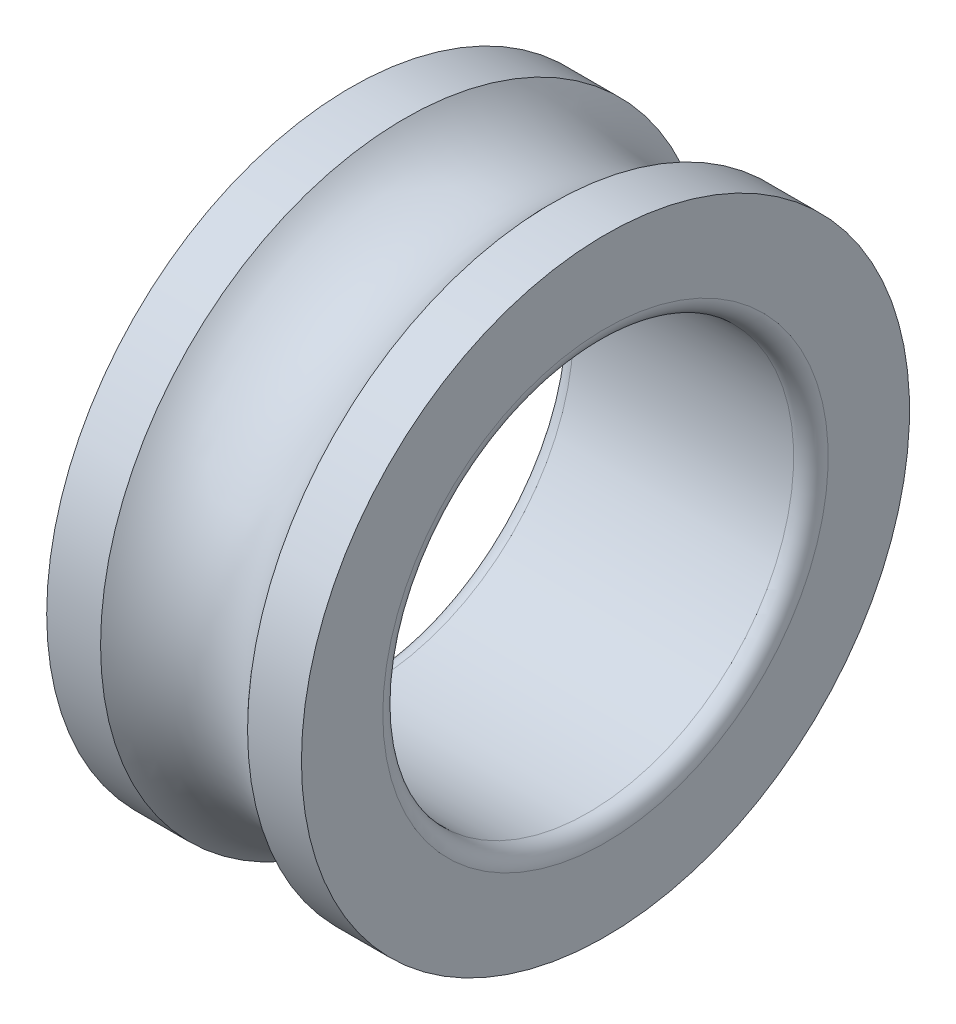
ISO-10303-21;
HEADER;
FILE_DESCRIPTION(('STEP AP214'),'2;1');
FILE_NAME('part.step','',(''),(''),'','','');
FILE_SCHEMA(('AUTOMOTIVE_DESIGN { 1 0 10303 214 1 1 1 1 }'));
ENDSEC;
DATA;
#1=APPLICATION_CONTEXT('core data for automotive mechanical design processes');
#2=APPLICATION_PROTOCOL_DEFINITION('international standard','automotive_design',2000,#1);
#3=PRODUCT_CONTEXT('',#1,'mechanical');
#4=PRODUCT('Part','Part','',(#3));
#5=PRODUCT_RELATED_PRODUCT_CATEGORY('part','',(#4));
#6=PRODUCT_DEFINITION_FORMATION('','',#4);
#7=PRODUCT_DEFINITION_CONTEXT('part definition',#1,'design');
#8=PRODUCT_DEFINITION('design','',#6,#7);
#9=PRODUCT_DEFINITION_SHAPE('','',#8);
#10=(LENGTH_UNIT() NAMED_UNIT(*) SI_UNIT(.MILLI.,.METRE.));
#11=(NAMED_UNIT(*) PLANE_ANGLE_UNIT() SI_UNIT($,.RADIAN.));
#12=(NAMED_UNIT(*) SI_UNIT($,.STERADIAN.) SOLID_ANGLE_UNIT());
#13=UNCERTAINTY_MEASURE_WITH_UNIT(LENGTH_MEASURE(1.E-05),#10,'distance_accuracy_value','');
#14=(GEOMETRIC_REPRESENTATION_CONTEXT(3) GLOBAL_UNCERTAINTY_ASSIGNED_CONTEXT((#13)) GLOBAL_UNIT_ASSIGNED_CONTEXT((#10,
#11,#12)) REPRESENTATION_CONTEXT('',''));
#15=CARTESIAN_POINT('',(0.,0.,0.));
#16=DIRECTION('',(0.,0.,1.));
#17=DIRECTION('',(1.,0.,0.));
#18=AXIS2_PLACEMENT_3D('',#15,#16,#17);
#19=CARTESIAN_POINT('',(-2.93684210526316,0.,0.));
#20=DIRECTION('',(-1.,0.,0.));
#21=DIRECTION('',(0.,0.,1.));
#22=AXIS2_PLACEMENT_3D('',#19,#20,#21);
#23=CYLINDRICAL_SURFACE('',#22,4.44);
#24=CARTESIAN_POINT('',(1.0733126291999,0.,0.));
#25=DIRECTION('',(-1.,0.,0.));
#26=DIRECTION('',(0.,0.,1.));
#27=AXIS2_PLACEMENT_3D('',#24,#25,#26);
#28=CIRCLE('',#27,4.44);
#29=CARTESIAN_POINT('',(1.0733126291999,0.,4.44));
#30=VERTEX_POINT('',#29);
#31=EDGE_CURVE('E10',#30,#30,#28,.T.);
#32=ORIENTED_EDGE('',*,*,#31,.F.);
#33=EDGE_LOOP('',(#32));
#34=FACE_BOUND('',#33,.T.);
#35=CARTESIAN_POINT('',(1.86,0.,0.));
#36=DIRECTION('',(-1.,0.,0.));
#37=DIRECTION('',(0.,0.,1.));
#38=AXIS2_PLACEMENT_3D('',#35,#36,#37);
#39=CIRCLE('',#38,4.44);
#40=CARTESIAN_POINT('',(1.86,0.,4.44));
#41=VERTEX_POINT('',#40);
#42=EDGE_CURVE('E66',#41,#41,#39,.T.);
#43=ORIENTED_EDGE('',*,*,#42,.T.);
#44=EDGE_LOOP('',(#43));
#45=FACE_BOUND('',#44,.T.);
#46=ADVANCED_FACE('F38',(#34,#45),#23,.T.);
#47=CARTESIAN_POINT('',(0.,0.,0.));
#48=DIRECTION('',(-1.,0.,0.));
#49=DIRECTION('',(0.,0.,1.));
#50=AXIS2_PLACEMENT_3D('',#47,#48,#49);
#51=TOROIDAL_SURFACE('',#50,5.4,1.44);
#52=CARTESIAN_POINT('',(-1.0733126291999,0.,0.));
#53=DIRECTION('',(-1.,0.,0.));
#54=DIRECTION('',(0.,0.,1.));
#55=AXIS2_PLACEMENT_3D('',#52,#53,#54);
#56=CIRCLE('',#55,4.44);
#57=CARTESIAN_POINT('',(-1.0733126291999,0.,4.44));
#58=VERTEX_POINT('',#57);
#59=EDGE_CURVE('E44',#58,#58,#56,.T.);
#60=ORIENTED_EDGE('',*,*,#59,.F.);
#61=EDGE_LOOP('',(#60));
#62=FACE_BOUND('',#61,.T.);
#63=ORIENTED_EDGE('',*,*,#31,.T.);
#64=EDGE_LOOP('',(#63));
#65=FACE_BOUND('',#64,.T.);
#66=ADVANCED_FACE('F103',(#62,#65),#51,.F.);
#67=CARTESIAN_POINT('',(-2.93684210526316,0.,0.));
#68=DIRECTION('',(-1.,0.,0.));
#69=DIRECTION('',(0.,0.,1.));
#70=AXIS2_PLACEMENT_3D('',#67,#68,#69);
#71=CYLINDRICAL_SURFACE('',#70,4.44);
#72=CARTESIAN_POINT('',(-1.86,0.,0.));
#73=DIRECTION('',(-1.,0.,0.));
#74=DIRECTION('',(0.,0.,1.));
#75=AXIS2_PLACEMENT_3D('',#72,#73,#74);
#76=CIRCLE('',#75,4.44);
#77=CARTESIAN_POINT('',(-1.86,0.,4.44));
#78=VERTEX_POINT('',#77);
#79=EDGE_CURVE('E48',#78,#78,#76,.T.);
#80=ORIENTED_EDGE('',*,*,#79,.F.);
#81=EDGE_LOOP('',(#80));
#82=FACE_BOUND('',#81,.T.);
#83=ORIENTED_EDGE('',*,*,#59,.T.);
#84=EDGE_LOOP('',(#83));
#85=FACE_BOUND('',#84,.T.);
#86=ADVANCED_FACE('F98',(#82,#85),#71,.T.);
#87=CARTESIAN_POINT('',(-1.86,3.252,0.));
#88=DIRECTION('',(1.,0.,0.));
#89=DIRECTION('',(0.,0.,-1.));
#90=AXIS2_PLACEMENT_3D('',#87,#88,#89);
#91=PLANE('',#90);
#92=CARTESIAN_POINT('',(-1.86,0.,0.));
#93=DIRECTION('',(-1.,0.,0.));
#94=DIRECTION('',(0.,0.,1.));
#95=AXIS2_PLACEMENT_3D('',#92,#93,#94);
#96=CIRCLE('',#95,3.252);
#97=CARTESIAN_POINT('',(-1.86,0.,3.252));
#98=VERTEX_POINT('',#97);
#99=EDGE_CURVE('E52',#98,#98,#96,.T.);
#100=ORIENTED_EDGE('',*,*,#99,.F.);
#101=EDGE_LOOP('',(#100));
#102=FACE_BOUND('',#101,.T.);
#103=ORIENTED_EDGE('',*,*,#79,.T.);
#104=EDGE_LOOP('',(#103));
#105=FACE_BOUND('',#104,.T.);
#106=ADVANCED_FACE('F92',(#102,#105),#91,.F.);
#107=CARTESIAN_POINT('',(-1.608,0.,0.));
#108=DIRECTION('',(-1.,0.,0.));
#109=DIRECTION('',(0.,0.,1.));
#110=AXIS2_PLACEMENT_3D('',#107,#108,#109);
#111=TOROIDAL_SURFACE('',#110,3.252,0.252);
#112=CARTESIAN_POINT('',(-1.608,0.,0.));
#113=DIRECTION('',(-1.,0.,0.));
#114=DIRECTION('',(0.,0.,1.));
#115=AXIS2_PLACEMENT_3D('',#112,#113,#114);
#116=CIRCLE('',#115,3.);
#117=CARTESIAN_POINT('',(-1.608,0.,3.));
#118=VERTEX_POINT('',#117);
#119=EDGE_CURVE('E57',#118,#118,#116,.T.);
#120=ORIENTED_EDGE('',*,*,#119,.F.);
#121=EDGE_LOOP('',(#120));
#122=FACE_BOUND('',#121,.T.);
#123=ORIENTED_EDGE('',*,*,#99,.T.);
#124=EDGE_LOOP('',(#123));
#125=FACE_BOUND('',#124,.T.);
#126=ADVANCED_FACE('F86',(#122,#125),#111,.T.);
#127=CARTESIAN_POINT('',(-2.93684210526316,0.,0.));
#128=DIRECTION('',(-1.,0.,0.));
#129=DIRECTION('',(0.,0.,1.));
#130=AXIS2_PLACEMENT_3D('',#127,#128,#129);
#131=CYLINDRICAL_SURFACE('',#130,3.);
#132=CARTESIAN_POINT('',(1.608,0.,0.));
#133=DIRECTION('',(-1.,0.,0.));
#134=DIRECTION('',(0.,0.,1.));
#135=AXIS2_PLACEMENT_3D('',#132,#133,#134);
#136=CIRCLE('',#135,3.);
#137=CARTESIAN_POINT('',(1.608,0.,3.));
#138=VERTEX_POINT('',#137);
#139=EDGE_CURVE('E60',#138,#138,#136,.T.);
#140=ORIENTED_EDGE('',*,*,#139,.F.);
#141=EDGE_LOOP('',(#140));
#142=FACE_BOUND('',#141,.T.);
#143=ORIENTED_EDGE('',*,*,#119,.T.);
#144=EDGE_LOOP('',(#143));
#145=FACE_BOUND('',#144,.T.);
#146=ADVANCED_FACE('F80',(#142,#145),#131,.F.);
#147=CARTESIAN_POINT('',(1.608,0.,0.));
#148=DIRECTION('',(-1.,0.,0.));
#149=DIRECTION('',(0.,0.,1.));
#150=AXIS2_PLACEMENT_3D('',#147,#148,#149);
#151=TOROIDAL_SURFACE('',#150,3.252,0.252);
#152=CARTESIAN_POINT('',(1.86,0.,0.));
#153=DIRECTION('',(-1.,0.,0.));
#154=DIRECTION('',(0.,0.,1.));
#155=AXIS2_PLACEMENT_3D('',#152,#153,#154);
#156=CIRCLE('',#155,3.252);
#157=CARTESIAN_POINT('',(1.86,0.,3.252));
#158=VERTEX_POINT('',#157);
#159=EDGE_CURVE('E63',#158,#158,#156,.T.);
#160=ORIENTED_EDGE('',*,*,#159,.F.);
#161=EDGE_LOOP('',(#160));
#162=FACE_BOUND('',#161,.T.);
#163=ORIENTED_EDGE('',*,*,#139,.T.);
#164=EDGE_LOOP('',(#163));
#165=FACE_BOUND('',#164,.T.);
#166=ADVANCED_FACE('F74',(#162,#165),#151,.T.);
#167=CARTESIAN_POINT('',(1.86,3.252,0.));
#168=DIRECTION('',(-1.,0.,0.));
#169=DIRECTION('',(0.,0.,1.));
#170=AXIS2_PLACEMENT_3D('',#167,#168,#169);
#171=PLANE('',#170);
#172=ORIENTED_EDGE('',*,*,#42,.F.);
#173=EDGE_LOOP('',(#172));
#174=FACE_BOUND('',#173,.T.);
#175=ORIENTED_EDGE('',*,*,#159,.T.);
#176=EDGE_LOOP('',(#175));
#177=FACE_BOUND('',#176,.T.);
#178=ADVANCED_FACE('F71',(#174,#177),#171,.F.);
#179=CLOSED_SHELL('',(#46,#66,#86,#106,#126,#146,#166,#178));
#180=MANIFOLD_SOLID_BREP('B2',#179);
#181=ADVANCED_BREP_SHAPE_REPRESENTATION('',(#18,#180),#14);
#182=SHAPE_DEFINITION_REPRESENTATION(#9,#181);
ENDSEC;
END-ISO-10303-21;
